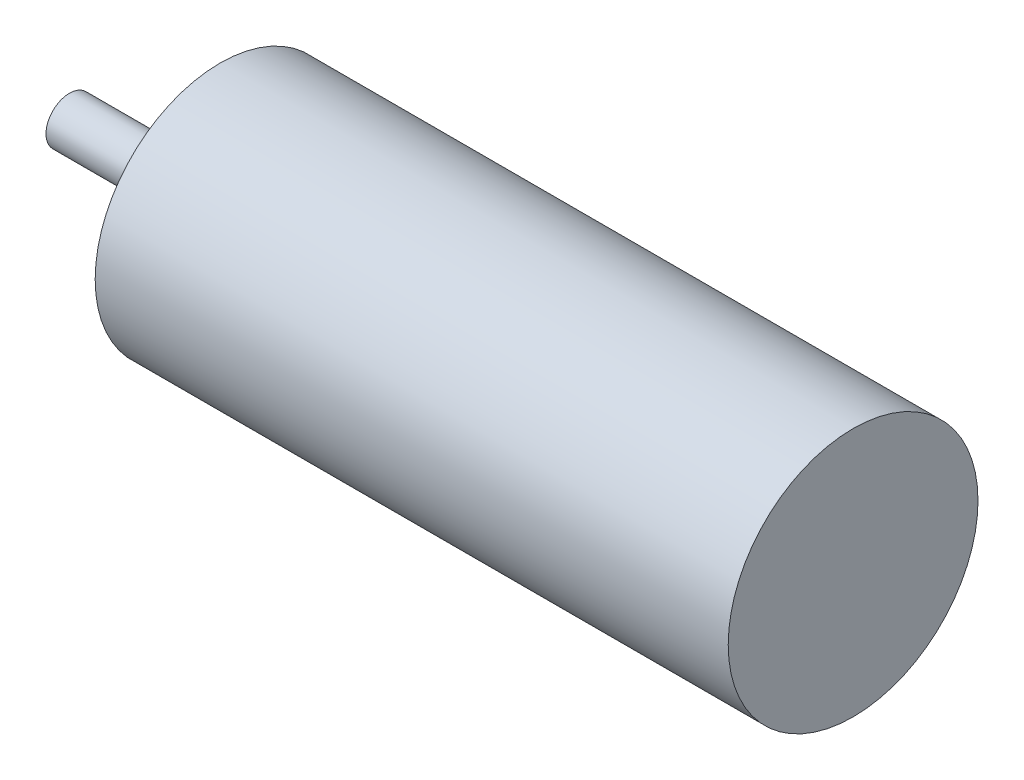
ISO-10303-21;
HEADER;
FILE_DESCRIPTION(('STEP AP214'),'2;1');
FILE_NAME('part.step','',(''),(''),'','','');
FILE_SCHEMA(('AUTOMOTIVE_DESIGN { 1 0 10303 214 1 1 1 1 }'));
ENDSEC;
DATA;
#1=APPLICATION_CONTEXT('core data for automotive mechanical design processes');
#2=APPLICATION_PROTOCOL_DEFINITION('international standard','automotive_design',2000,#1);
#3=PRODUCT_CONTEXT('',#1,'mechanical');
#4=PRODUCT('Part','Part','',(#3));
#5=PRODUCT_RELATED_PRODUCT_CATEGORY('part','',(#4));
#6=PRODUCT_DEFINITION_FORMATION('','',#4);
#7=PRODUCT_DEFINITION_CONTEXT('part definition',#1,'design');
#8=PRODUCT_DEFINITION('design','',#6,#7);
#9=PRODUCT_DEFINITION_SHAPE('','',#8);
#10=(LENGTH_UNIT() NAMED_UNIT(*) SI_UNIT(.MILLI.,.METRE.));
#11=(NAMED_UNIT(*) PLANE_ANGLE_UNIT() SI_UNIT($,.RADIAN.));
#12=(NAMED_UNIT(*) SI_UNIT($,.STERADIAN.) SOLID_ANGLE_UNIT());
#13=UNCERTAINTY_MEASURE_WITH_UNIT(LENGTH_MEASURE(1.E-05),#10,'distance_accuracy_value','');
#14=(GEOMETRIC_REPRESENTATION_CONTEXT(3) GLOBAL_UNCERTAINTY_ASSIGNED_CONTEXT((#13)) GLOBAL_UNIT_ASSIGNED_CONTEXT((#10,
#11,#12)) REPRESENTATION_CONTEXT('',''));
#15=CARTESIAN_POINT('',(0.,0.,0.));
#16=DIRECTION('',(0.,0.,1.));
#17=DIRECTION('',(1.,0.,0.));
#18=AXIS2_PLACEMENT_3D('',#15,#16,#17);
#19=CARTESIAN_POINT('',(0.,0.,0.));
#20=DIRECTION('',(1.,0.,0.));
#21=DIRECTION('',(0.,0.,-1.));
#22=AXIS2_PLACEMENT_3D('',#19,#20,#21);
#23=PLANE('',#22);
#24=CARTESIAN_POINT('',(0.,0.,0.));
#25=DIRECTION('',(-1.,0.,0.));
#26=DIRECTION('',(0.,0.,1.));
#27=AXIS2_PLACEMENT_3D('',#24,#25,#26);
#28=CIRCLE('',#27,3.);
#29=CARTESIAN_POINT('',(0.,0.,3.));
#30=VERTEX_POINT('',#29);
#31=EDGE_CURVE('E10',#30,#30,#28,.T.);
#32=ORIENTED_EDGE('',*,*,#31,.T.);
#33=EDGE_LOOP('',(#32));
#34=FACE_BOUND('',#33,.T.);
#35=ADVANCED_FACE('F32',(#34),#23,.F.);
#36=CARTESIAN_POINT('',(0.,0.,0.));
#37=DIRECTION('',(-1.,0.,0.));
#38=DIRECTION('',(0.,0.,1.));
#39=AXIS2_PLACEMENT_3D('',#36,#37,#38);
#40=CYLINDRICAL_SURFACE('',#39,3.);
#41=ORIENTED_EDGE('',*,*,#31,.F.);
#42=EDGE_LOOP('',(#41));
#43=FACE_BOUND('',#42,.T.);
#44=CARTESIAN_POINT('',(15.5,0.,0.));
#45=DIRECTION('',(-1.,0.,0.));
#46=DIRECTION('',(0.,0.,1.));
#47=AXIS2_PLACEMENT_3D('',#44,#45,#46);
#48=CIRCLE('',#47,3.);
#49=CARTESIAN_POINT('',(15.5,0.,3.));
#50=VERTEX_POINT('',#49);
#51=EDGE_CURVE('E38',#50,#50,#48,.T.);
#52=ORIENTED_EDGE('',*,*,#51,.T.);
#53=EDGE_LOOP('',(#52));
#54=FACE_BOUND('',#53,.T.);
#55=ADVANCED_FACE('F123',(#43,#54),#40,.T.);
#56=CARTESIAN_POINT('',(15.5,3.,0.));
#57=DIRECTION('',(1.,0.,0.));
#58=DIRECTION('',(0.,0.,-1.));
#59=AXIS2_PLACEMENT_3D('',#56,#57,#58);
#60=PLANE('',#59);
#61=ORIENTED_EDGE('',*,*,#51,.F.);
#62=EDGE_LOOP('',(#61));
#63=FACE_BOUND('',#62,.T.);
#64=CARTESIAN_POINT('',(15.5,0.,0.));
#65=DIRECTION('',(-1.,0.,0.));
#66=DIRECTION('',(0.,0.,1.));
#67=AXIS2_PLACEMENT_3D('',#64,#65,#66);
#68=CIRCLE('',#67,9.);
#69=CARTESIAN_POINT('',(15.5,0.,9.));
#70=VERTEX_POINT('',#69);
#71=EDGE_CURVE('E42',#70,#70,#68,.T.);
#72=ORIENTED_EDGE('',*,*,#71,.T.);
#73=EDGE_LOOP('',(#72));
#74=FACE_BOUND('',#73,.T.);
#75=ADVANCED_FACE('F127',(#63,#74),#60,.F.);
#76=CARTESIAN_POINT('',(0.,0.,0.));
#77=DIRECTION('',(-1.,0.,0.));
#78=DIRECTION('',(0.,0.,1.));
#79=AXIS2_PLACEMENT_3D('',#76,#77,#78);
#80=CYLINDRICAL_SURFACE('',#79,9.);
#81=ORIENTED_EDGE('',*,*,#71,.F.);
#82=EDGE_LOOP('',(#81));
#83=FACE_BOUND('',#82,.T.);
#84=CARTESIAN_POINT('',(19.3,0.,0.));
#85=DIRECTION('',(-1.,0.,0.));
#86=DIRECTION('',(0.,0.,1.));
#87=AXIS2_PLACEMENT_3D('',#84,#85,#86);
#88=CIRCLE('',#87,9.);
#89=CARTESIAN_POINT('',(19.3,0.,9.));
#90=VERTEX_POINT('',#89);
#91=EDGE_CURVE('E46',#90,#90,#88,.T.);
#92=ORIENTED_EDGE('',*,*,#91,.T.);
#93=EDGE_LOOP('',(#92));
#94=FACE_BOUND('',#93,.T.);
#95=ADVANCED_FACE('F95',(#83,#94),#80,.T.);
#96=CARTESIAN_POINT('',(19.3,9.,0.));
#97=DIRECTION('',(1.,0.,0.));
#98=DIRECTION('',(0.,0.,-1.));
#99=AXIS2_PLACEMENT_3D('',#96,#97,#98);
#100=PLANE('',#99);
#101=CARTESIAN_POINT('',(19.3,13.,0.));
#102=DIRECTION('',(-1.,0.,0.));
#103=DIRECTION('',(0.,0.,1.));
#104=AXIS2_PLACEMENT_3D('',#101,#102,#103);
#105=CIRCLE('',#104,1.5);
#106=CARTESIAN_POINT('',(19.3,13.,1.5));
#107=VERTEX_POINT('',#106);
#108=EDGE_CURVE('E76',#107,#107,#105,.T.);
#109=ORIENTED_EDGE('',*,*,#108,.F.);
#110=EDGE_LOOP('',(#109));
#111=FACE_BOUND('',#110,.T.);
#112=CARTESIAN_POINT('',(19.3,-13.,0.));
#113=DIRECTION('',(-1.,0.,0.));
#114=DIRECTION('',(0.,0.,1.));
#115=AXIS2_PLACEMENT_3D('',#112,#113,#114);
#116=CIRCLE('',#115,1.5);
#117=CARTESIAN_POINT('',(19.3,-13.,1.5));
#118=VERTEX_POINT('',#117);
#119=EDGE_CURVE('E70',#118,#118,#116,.T.);
#120=ORIENTED_EDGE('',*,*,#119,.F.);
#121=EDGE_LOOP('',(#120));
#122=FACE_BOUND('',#121,.T.);
#123=CARTESIAN_POINT('',(19.3,0.,-13.));
#124=DIRECTION('',(-1.,0.,0.));
#125=DIRECTION('',(0.,0.,1.));
#126=AXIS2_PLACEMENT_3D('',#123,#124,#125);
#127=CIRCLE('',#126,1.5);
#128=CARTESIAN_POINT('',(19.3,0.,-11.5));
#129=VERTEX_POINT('',#128);
#130=EDGE_CURVE('E64',#129,#129,#127,.T.);
#131=ORIENTED_EDGE('',*,*,#130,.F.);
#132=EDGE_LOOP('',(#131));
#133=FACE_BOUND('',#132,.T.);
#134=CARTESIAN_POINT('',(19.3,0.,13.));
#135=DIRECTION('',(-1.,0.,0.));
#136=DIRECTION('',(0.,0.,1.));
#137=AXIS2_PLACEMENT_3D('',#134,#135,#136);
#138=CIRCLE('',#137,1.5);
#139=CARTESIAN_POINT('',(19.3,0.,14.5));
#140=VERTEX_POINT('',#139);
#141=EDGE_CURVE('E58',#140,#140,#138,.T.);
#142=ORIENTED_EDGE('',*,*,#141,.F.);
#143=EDGE_LOOP('',(#142));
#144=FACE_BOUND('',#143,.T.);
#145=ORIENTED_EDGE('',*,*,#91,.F.);
#146=EDGE_LOOP('',(#145));
#147=FACE_BOUND('',#146,.T.);
#148=CARTESIAN_POINT('',(19.3,0.,0.));
#149=DIRECTION('',(-1.,0.,0.));
#150=DIRECTION('',(0.,0.,1.));
#151=AXIS2_PLACEMENT_3D('',#148,#149,#150);
#152=CIRCLE('',#151,16.);
#153=CARTESIAN_POINT('',(19.3,0.,16.));
#154=VERTEX_POINT('',#153);
#155=EDGE_CURVE('E51',#154,#154,#152,.T.);
#156=ORIENTED_EDGE('',*,*,#155,.T.);
#157=EDGE_LOOP('',(#156));
#158=FACE_BOUND('',#157,.T.);
#159=ADVANCED_FACE('F91',(#111,#122,#133,#144,#147,#158),#100,.F.);
#160=CARTESIAN_POINT('',(0.,0.,0.));
#161=DIRECTION('',(-1.,0.,0.));
#162=DIRECTION('',(0.,0.,1.));
#163=AXIS2_PLACEMENT_3D('',#160,#161,#162);
#164=CYLINDRICAL_SURFACE('',#163,16.);
#165=ORIENTED_EDGE('',*,*,#155,.F.);
#166=EDGE_LOOP('',(#165));
#167=FACE_BOUND('',#166,.T.);
#168=CARTESIAN_POINT('',(100.4,0.,0.));
#169=DIRECTION('',(-1.,0.,0.));
#170=DIRECTION('',(0.,0.,1.));
#171=AXIS2_PLACEMENT_3D('',#168,#169,#170);
#172=CIRCLE('',#171,16.);
#173=CARTESIAN_POINT('',(100.4,0.,16.));
#174=VERTEX_POINT('',#173);
#175=EDGE_CURVE('E54',#174,#174,#172,.T.);
#176=ORIENTED_EDGE('',*,*,#175,.T.);
#177=EDGE_LOOP('',(#176));
#178=FACE_BOUND('',#177,.T.);
#179=ADVANCED_FACE('F94',(#167,#178),#164,.T.);
#180=CARTESIAN_POINT('',(100.4,16.,0.));
#181=DIRECTION('',(-1.,0.,0.));
#182=DIRECTION('',(0.,0.,1.));
#183=AXIS2_PLACEMENT_3D('',#180,#181,#182);
#184=PLANE('',#183);
#185=ORIENTED_EDGE('',*,*,#175,.F.);
#186=EDGE_LOOP('',(#185));
#187=FACE_BOUND('',#186,.T.);
#188=ADVANCED_FACE('F109',(#187),#184,.F.);
#189=CARTESIAN_POINT('',(24.3,0.,13.));
#190=DIRECTION('',(-1.,0.,0.));
#191=DIRECTION('',(0.,0.,1.));
#192=AXIS2_PLACEMENT_3D('',#189,#190,#191);
#193=CYLINDRICAL_SURFACE('',#192,1.5);
#194=CARTESIAN_POINT('',(24.3,0.,13.));
#195=DIRECTION('',(-1.,0.,0.));
#196=DIRECTION('',(0.,0.,1.));
#197=AXIS2_PLACEMENT_3D('',#194,#195,#196);
#198=CIRCLE('',#197,1.5);
#199=CARTESIAN_POINT('',(24.3,0.,14.5));
#200=VERTEX_POINT('',#199);
#201=EDGE_CURVE('E61',#200,#200,#198,.T.);
#202=ORIENTED_EDGE('',*,*,#201,.F.);
#203=EDGE_LOOP('',(#202));
#204=FACE_BOUND('',#203,.T.);
#205=ORIENTED_EDGE('',*,*,#141,.T.);
#206=EDGE_LOOP('',(#205));
#207=FACE_BOUND('',#206,.T.);
#208=ADVANCED_FACE('F114',(#204,#207),#193,.F.);
#209=CARTESIAN_POINT('',(24.3,0.,13.));
#210=DIRECTION('',(-1.,0.,0.));
#211=DIRECTION('',(0.,0.,1.));
#212=AXIS2_PLACEMENT_3D('',#209,#210,#211);
#213=PLANE('',#212);
#214=ORIENTED_EDGE('',*,*,#201,.T.);
#215=EDGE_LOOP('',(#214));
#216=FACE_BOUND('',#215,.T.);
#217=ADVANCED_FACE('F119',(#216),#213,.T.);
#218=CARTESIAN_POINT('',(24.3,0.,-13.));
#219=DIRECTION('',(-1.,0.,0.));
#220=DIRECTION('',(0.,0.,1.));
#221=AXIS2_PLACEMENT_3D('',#218,#219,#220);
#222=CYLINDRICAL_SURFACE('',#221,1.5);
#223=CARTESIAN_POINT('',(24.3,0.,-13.));
#224=DIRECTION('',(-1.,0.,0.));
#225=DIRECTION('',(0.,0.,1.));
#226=AXIS2_PLACEMENT_3D('',#223,#224,#225);
#227=CIRCLE('',#226,1.5);
#228=CARTESIAN_POINT('',(24.3,0.,-11.5));
#229=VERTEX_POINT('',#228);
#230=EDGE_CURVE('E67',#229,#229,#227,.T.);
#231=ORIENTED_EDGE('',*,*,#230,.F.);
#232=EDGE_LOOP('',(#231));
#233=FACE_BOUND('',#232,.T.);
#234=ORIENTED_EDGE('',*,*,#130,.T.);
#235=EDGE_LOOP('',(#234));
#236=FACE_BOUND('',#235,.T.);
#237=ADVANCED_FACE('F171',(#233,#236),#222,.F.);
#238=CARTESIAN_POINT('',(24.3,0.,-13.));
#239=DIRECTION('',(-1.,0.,0.));
#240=DIRECTION('',(0.,0.,1.));
#241=AXIS2_PLACEMENT_3D('',#238,#239,#240);
#242=PLANE('',#241);
#243=ORIENTED_EDGE('',*,*,#230,.T.);
#244=EDGE_LOOP('',(#243));
#245=FACE_BOUND('',#244,.T.);
#246=ADVANCED_FACE('F180',(#245),#242,.T.);
#247=CARTESIAN_POINT('',(24.3,-13.,0.));
#248=DIRECTION('',(-1.,0.,0.));
#249=DIRECTION('',(0.,0.,1.));
#250=AXIS2_PLACEMENT_3D('',#247,#248,#249);
#251=CYLINDRICAL_SURFACE('',#250,1.5);
#252=CARTESIAN_POINT('',(24.3,-13.,0.));
#253=DIRECTION('',(-1.,0.,0.));
#254=DIRECTION('',(0.,0.,1.));
#255=AXIS2_PLACEMENT_3D('',#252,#253,#254);
#256=CIRCLE('',#255,1.5);
#257=CARTESIAN_POINT('',(24.3,-13.,1.5));
#258=VERTEX_POINT('',#257);
#259=EDGE_CURVE('E73',#258,#258,#256,.T.);
#260=ORIENTED_EDGE('',*,*,#259,.F.);
#261=EDGE_LOOP('',(#260));
#262=FACE_BOUND('',#261,.T.);
#263=ORIENTED_EDGE('',*,*,#119,.T.);
#264=EDGE_LOOP('',(#263));
#265=FACE_BOUND('',#264,.T.);
#266=ADVANCED_FACE('F189',(#262,#265),#251,.F.);
#267=CARTESIAN_POINT('',(24.3,-13.,0.));
#268=DIRECTION('',(-1.,0.,0.));
#269=DIRECTION('',(0.,0.,1.));
#270=AXIS2_PLACEMENT_3D('',#267,#268,#269);
#271=PLANE('',#270);
#272=ORIENTED_EDGE('',*,*,#259,.T.);
#273=EDGE_LOOP('',(#272));
#274=FACE_BOUND('',#273,.T.);
#275=ADVANCED_FACE('F87',(#274),#271,.T.);
#276=CARTESIAN_POINT('',(24.3,13.,0.));
#277=DIRECTION('',(-1.,0.,0.));
#278=DIRECTION('',(0.,0.,1.));
#279=AXIS2_PLACEMENT_3D('',#276,#277,#278);
#280=CYLINDRICAL_SURFACE('',#279,1.5);
#281=CARTESIAN_POINT('',(24.3,13.,0.));
#282=DIRECTION('',(-1.,0.,0.));
#283=DIRECTION('',(0.,0.,1.));
#284=AXIS2_PLACEMENT_3D('',#281,#282,#283);
#285=CIRCLE('',#284,1.5);
#286=CARTESIAN_POINT('',(24.3,13.,1.5));
#287=VERTEX_POINT('',#286);
#288=EDGE_CURVE('E57',#287,#287,#285,.T.);
#289=ORIENTED_EDGE('',*,*,#288,.F.);
#290=EDGE_LOOP('',(#289));
#291=FACE_BOUND('',#290,.T.);
#292=ORIENTED_EDGE('',*,*,#108,.T.);
#293=EDGE_LOOP('',(#292));
#294=FACE_BOUND('',#293,.T.);
#295=ADVANCED_FACE('F84',(#291,#294),#280,.F.);
#296=CARTESIAN_POINT('',(24.3,13.,0.));
#297=DIRECTION('',(-1.,0.,0.));
#298=DIRECTION('',(0.,0.,1.));
#299=AXIS2_PLACEMENT_3D('',#296,#297,#298);
#300=PLANE('',#299);
#301=ORIENTED_EDGE('',*,*,#288,.T.);
#302=EDGE_LOOP('',(#301));
#303=FACE_BOUND('',#302,.T.);
#304=ADVANCED_FACE('F82',(#303),#300,.T.);
#305=CLOSED_SHELL('',(#35,#55,#75,#95,#159,#179,#188,#208,#217,#237,#246,#266,#275,#295,#304));
#306=MANIFOLD_SOLID_BREP('B2',#305);
#307=ADVANCED_BREP_SHAPE_REPRESENTATION('',(#18,#306),#14);
#308=SHAPE_DEFINITION_REPRESENTATION(#9,#307);
ENDSEC;
END-ISO-10303-21;
